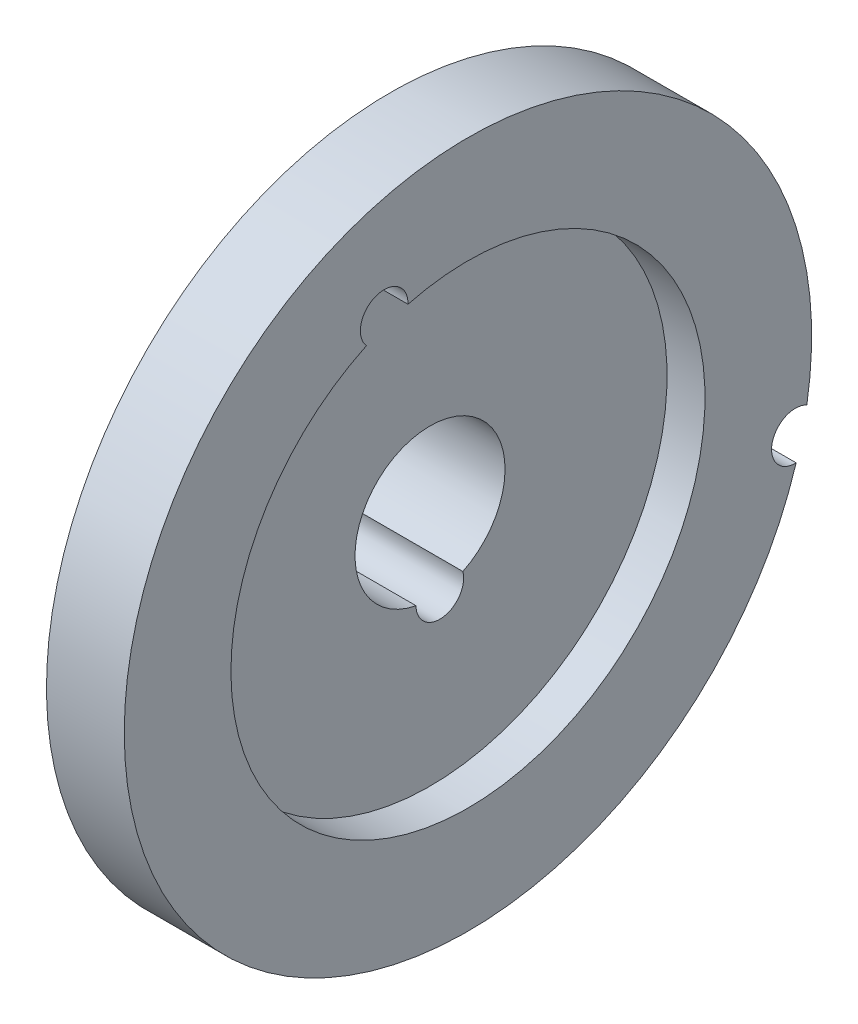
ISO-10303-21;
HEADER;
FILE_DESCRIPTION(('STEP AP214'),'2;1');
FILE_NAME('part.step','',(''),(''),'','','');
FILE_SCHEMA(('AUTOMOTIVE_DESIGN { 1 0 10303 214 1 1 1 1 }'));
ENDSEC;
DATA;
#1=APPLICATION_CONTEXT('core data for automotive mechanical design processes');
#2=APPLICATION_PROTOCOL_DEFINITION('international standard','automotive_design',2000,#1);
#3=PRODUCT_CONTEXT('',#1,'mechanical');
#4=PRODUCT('Part','Part','',(#3));
#5=PRODUCT_RELATED_PRODUCT_CATEGORY('part','',(#4));
#6=PRODUCT_DEFINITION_FORMATION('','',#4);
#7=PRODUCT_DEFINITION_CONTEXT('part definition',#1,'design');
#8=PRODUCT_DEFINITION('design','',#6,#7);
#9=PRODUCT_DEFINITION_SHAPE('','',#8);
#10=(LENGTH_UNIT() NAMED_UNIT(*) SI_UNIT(.MILLI.,.METRE.));
#11=(NAMED_UNIT(*) PLANE_ANGLE_UNIT() SI_UNIT($,.RADIAN.));
#12=(NAMED_UNIT(*) SI_UNIT($,.STERADIAN.) SOLID_ANGLE_UNIT());
#13=UNCERTAINTY_MEASURE_WITH_UNIT(LENGTH_MEASURE(1.E-05),#10,'distance_accuracy_value','');
#14=(GEOMETRIC_REPRESENTATION_CONTEXT(3) GLOBAL_UNCERTAINTY_ASSIGNED_CONTEXT((#13)) GLOBAL_UNIT_ASSIGNED_CONTEXT((#10,
#11,#12)) REPRESENTATION_CONTEXT('',''));
#15=CARTESIAN_POINT('',(0.,0.,0.));
#16=DIRECTION('',(0.,0.,1.));
#17=DIRECTION('',(1.,0.,0.));
#18=AXIS2_PLACEMENT_3D('',#15,#16,#17);
#19=CARTESIAN_POINT('',(-27.8572788918953,17.8013392215415,0.));
#20=DIRECTION('',(-1.,0.,0.));
#21=DIRECTION('',(0.,0.,1.));
#22=AXIS2_PLACEMENT_3D('',#19,#20,#21);
#23=PLANE('',#22);
#24=CARTESIAN_POINT('',(-27.8572788918953,-7.87461154428951,-1.05067261297217));
#25=DIRECTION('',(1.,0.,0.));
#26=DIRECTION('',(0.,0.,-1.));
#27=AXIS2_PLACEMENT_3D('',#24,#25,#26);
#28=CIRCLE('',#27,2.55270000000001);
#29=CARTESIAN_POINT('',(-27.8572788918953,-7.89755356007511,1.50192429094975));
#30=VERTEX_POINT('',#29);
#31=CARTESIAN_POINT('',(-27.8572788918953,-7.22750302201927,-3.51998989724434));
#32=VERTEX_POINT('',#31);
#33=EDGE_CURVE('E106',#30,#32,#28,.T.);
#34=ORIENTED_EDGE('',*,*,#33,.T.);
#35=CARTESIAN_POINT('',(-27.8572788918953,0.,0.));
#36=DIRECTION('',(1.,0.,0.));
#37=DIRECTION('',(0.,0.,-1.));
#38=AXIS2_PLACEMENT_3D('',#35,#36,#37);
#39=CIRCLE('',#38,8.0391);
#40=EDGE_CURVE('E124',#32,#30,#39,.T.);
#41=ORIENTED_EDGE('',*,*,#40,.T.);
#42=EDGE_LOOP('',(#34,#41));
#43=FACE_BOUND('',#42,.T.);
#44=CARTESIAN_POINT('',(-27.8572788918953,0.,0.));
#45=DIRECTION('',(1.,0.,0.));
#46=DIRECTION('',(0.,0.,-1.));
#47=AXIS2_PLACEMENT_3D('',#44,#45,#46);
#48=CIRCLE('',#47,17.8013392215415);
#49=CARTESIAN_POINT('',(-27.8572788918953,0.,-17.8013392215415));
#50=VERTEX_POINT('',#49);
#51=EDGE_CURVE('E115',#50,#50,#48,.T.);
#52=ORIENTED_EDGE('',*,*,#51,.F.);
#53=EDGE_LOOP('',(#52));
#54=FACE_BOUND('',#53,.T.);
#55=ADVANCED_FACE('F39',(#43,#54),#23,.T.);
#56=CARTESIAN_POINT('',(0.,0.,0.));
#57=DIRECTION('',(1.,0.,0.));
#58=DIRECTION('',(0.,0.,-1.));
#59=AXIS2_PLACEMENT_3D('',#56,#57,#58);
#60=CYLINDRICAL_SURFACE('',#59,8.0391);
#61=DIRECTION('',(1.,0.,0.));
#62=VECTOR('',#61,1.);
#63=CARTESIAN_POINT('',(-18.9086869451702,-7.22750302201927,-3.51998989724434));
#64=LINE('',#63,#62);
#65=CARTESIAN_POINT('',(-14.0240949984451,-7.22750302201927,-3.51998989724434));
#66=VERTEX_POINT('',#65);
#67=EDGE_CURVE('E165',#66,#32,#64,.F.);
#68=ORIENTED_EDGE('',*,*,#67,.F.);
#69=CARTESIAN_POINT('',(-14.0240949984451,0.,0.));
#70=DIRECTION('',(1.,0.,0.));
#71=DIRECTION('',(0.,0.,-1.));
#72=AXIS2_PLACEMENT_3D('',#69,#70,#71);
#73=CIRCLE('',#72,8.0391);
#74=CARTESIAN_POINT('',(-14.0240949984451,-7.89755356007511,1.50192429094975));
#75=VERTEX_POINT('',#74);
#76=EDGE_CURVE('E121',#66,#75,#73,.T.);
#77=ORIENTED_EDGE('',*,*,#76,.T.);
#78=DIRECTION('',(1.,0.,0.));
#79=VECTOR('',#78,1.);
#80=CARTESIAN_POINT('',(-18.9086869451702,-7.89755356007511,1.50192429094975));
#81=LINE('',#80,#79);
#82=EDGE_CURVE('E52',#30,#75,#81,.T.);
#83=ORIENTED_EDGE('',*,*,#82,.F.);
#84=ORIENTED_EDGE('',*,*,#40,.F.);
#85=EDGE_LOOP('',(#68,#77,#83,#84));
#86=FACE_BOUND('',#85,.T.);
#87=ADVANCED_FACE('F152',(#86),#60,.F.);
#88=CARTESIAN_POINT('',(-14.0240949984451,8.0391,0.));
#89=DIRECTION('',(1.,0.,0.));
#90=DIRECTION('',(0.,0.,-1.));
#91=AXIS2_PLACEMENT_3D('',#88,#89,#90);
#92=PLANE('',#91);
#93=CARTESIAN_POINT('',(-14.0240949984451,-7.87461154428951,-1.05067261297217));
#94=DIRECTION('',(1.,0.,0.));
#95=DIRECTION('',(0.,0.,-1.));
#96=AXIS2_PLACEMENT_3D('',#93,#94,#95);
#97=CIRCLE('',#96,2.55270000000001);
#98=EDGE_CURVE('E11',#75,#66,#97,.T.);
#99=ORIENTED_EDGE('',*,*,#98,.F.);
#100=ORIENTED_EDGE('',*,*,#76,.F.);
#101=EDGE_LOOP('',(#99,#100));
#102=FACE_BOUND('',#101,.T.);
#103=CARTESIAN_POINT('',(-14.0240949984451,24.6544495767758,8.97776177474859));
#104=DIRECTION('',(1.,0.,0.));
#105=DIRECTION('',(0.,0.,-1.));
#106=AXIS2_PLACEMENT_3D('',#103,#104,#105);
#107=CIRCLE('',#106,2.5527);
#108=CARTESIAN_POINT('',(-14.0240949984451,22.9519165222403,10.8797760986205));
#109=VERTEX_POINT('',#108);
#110=CARTESIAN_POINT('',(-14.0240949984451,24.5736062765692,6.42634223833132));
#111=VERTEX_POINT('',#110);
#112=EDGE_CURVE('E171',#109,#111,#107,.T.);
#113=ORIENTED_EDGE('',*,*,#112,.F.);
#114=CARTESIAN_POINT('',(-14.0240949984451,0.,0.));
#115=DIRECTION('',(1.,0.,0.));
#116=DIRECTION('',(0.,0.,-1.));
#117=AXIS2_PLACEMENT_3D('',#114,#115,#116);
#118=CIRCLE('',#117,25.4);
#119=EDGE_CURVE('E113',#109,#111,#118,.T.);
#120=ORIENTED_EDGE('',*,*,#119,.T.);
#121=EDGE_LOOP('',(#113,#120));
#122=FACE_BOUND('',#121,.T.);
#123=ADVANCED_FACE('F157',(#102,#122),#92,.T.);
#124=CARTESIAN_POINT('',(0.,0.,0.));
#125=DIRECTION('',(1.,0.,0.));
#126=DIRECTION('',(0.,0.,-1.));
#127=AXIS2_PLACEMENT_3D('',#124,#125,#126);
#128=CYLINDRICAL_SURFACE('',#127,25.4);
#129=DIRECTION('',(1.,0.,0.));
#130=VECTOR('',#129,1.);
#131=CARTESIAN_POINT('',(-18.9086869451702,22.9519165222403,10.8797760986205));
#132=LINE('',#131,#130);
#133=CARTESIAN_POINT('',(-9.9600949984451,22.9519165222403,10.8797760986205));
#134=VERTEX_POINT('',#133);
#135=EDGE_CURVE('E169',#134,#109,#132,.F.);
#136=ORIENTED_EDGE('',*,*,#135,.F.);
#137=CARTESIAN_POINT('',(-9.9600949984451,0.,0.));
#138=DIRECTION('',(1.,0.,0.));
#139=DIRECTION('',(0.,0.,-1.));
#140=AXIS2_PLACEMENT_3D('',#137,#138,#139);
#141=CIRCLE('',#140,25.4);
#142=CARTESIAN_POINT('',(-9.9600949984451,24.5736062765692,6.42634223833129));
#143=VERTEX_POINT('',#142);
#144=EDGE_CURVE('E109',#134,#143,#141,.T.);
#145=ORIENTED_EDGE('',*,*,#144,.T.);
#146=DIRECTION('',(1.,0.,0.));
#147=VECTOR('',#146,1.);
#148=CARTESIAN_POINT('',(-18.9086869451702,24.5736062765692,6.42634223833132));
#149=LINE('',#148,#147);
#150=EDGE_CURVE('E60',#111,#143,#149,.T.);
#151=ORIENTED_EDGE('',*,*,#150,.F.);
#152=ORIENTED_EDGE('',*,*,#119,.F.);
#153=EDGE_LOOP('',(#136,#145,#151,#152));
#154=FACE_BOUND('',#153,.T.);
#155=ADVANCED_FACE('F183',(#154),#128,.F.);
#156=CARTESIAN_POINT('',(-9.9600949984451,25.4,0.));
#157=DIRECTION('',(1.,0.,0.));
#158=DIRECTION('',(0.,0.,-1.));
#159=AXIS2_PLACEMENT_3D('',#156,#157,#158);
#160=PLANE('',#159);
#161=CARTESIAN_POINT('',(-9.9600949984451,24.6544495767758,8.97776177474859));
#162=DIRECTION('',(1.,0.,0.));
#163=DIRECTION('',(0.,0.,-1.));
#164=AXIS2_PLACEMENT_3D('',#161,#162,#163);
#165=CIRCLE('',#164,2.5527);
#166=EDGE_CURVE('E176',#143,#134,#165,.T.);
#167=ORIENTED_EDGE('',*,*,#166,.F.);
#168=ORIENTED_EDGE('',*,*,#144,.F.);
#169=EDGE_LOOP('',(#167,#168));
#170=FACE_BOUND('',#169,.T.);
#171=CARTESIAN_POINT('',(-9.9600949984451,-8.38903636907986,-35.0866048139046));
#172=DIRECTION('',(1.,0.,0.));
#173=DIRECTION('',(0.,0.,-1.));
#174=AXIS2_PLACEMENT_3D('',#171,#172,#173);
#175=CIRCLE('',#174,2.5527);
#176=CARTESIAN_POINT('',(-9.9600949984451,-6.15016269402234,-36.3128682265262));
#177=VERTEX_POINT('',#176);
#178=CARTESIAN_POINT('',(-9.9600949984451,-10.9404532116177,-35.1675330884099));
#179=VERTEX_POINT('',#178);
#180=EDGE_CURVE('E92',#177,#179,#175,.T.);
#181=ORIENTED_EDGE('',*,*,#180,.F.);
#182=CARTESIAN_POINT('',(-9.9600949984451,0.,0.));
#183=DIRECTION('',(1.,0.,0.));
#184=DIRECTION('',(0.,0.,-1.));
#185=AXIS2_PLACEMENT_3D('',#182,#183,#184);
#186=CIRCLE('',#185,36.83);
#187=EDGE_CURVE('E105',#177,#179,#186,.T.);
#188=ORIENTED_EDGE('',*,*,#187,.T.);
#189=EDGE_LOOP('',(#181,#188));
#190=FACE_BOUND('',#189,.T.);
#191=ADVANCED_FACE('F104',(#170,#190),#160,.T.);
#192=CARTESIAN_POINT('',(0.,0.,0.));
#193=DIRECTION('',(1.,0.,0.));
#194=DIRECTION('',(0.,0.,-1.));
#195=AXIS2_PLACEMENT_3D('',#192,#193,#194);
#196=CYLINDRICAL_SURFACE('',#195,36.83);
#197=DIRECTION('',(1.,0.,0.));
#198=VECTOR('',#197,1.);
#199=CARTESIAN_POINT('',(-18.9086869451702,-6.15016269402234,-36.3128682265262));
#200=LINE('',#199,#198);
#201=CARTESIAN_POINT('',(-18.2957572874948,-6.15016269402234,-36.3128682265262));
#202=VERTEX_POINT('',#201);
#203=EDGE_CURVE('E89',#202,#177,#200,.T.);
#204=ORIENTED_EDGE('',*,*,#203,.F.);
#205=CARTESIAN_POINT('',(-18.2957572874948,0.,0.));
#206=DIRECTION('',(1.,0.,0.));
#207=DIRECTION('',(0.,0.,-1.));
#208=AXIS2_PLACEMENT_3D('',#205,#206,#207);
#209=CIRCLE('',#208,36.83);
#210=CARTESIAN_POINT('',(-18.2957572874948,-10.9404532116177,-35.1675330884099));
#211=VERTEX_POINT('',#210);
#212=EDGE_CURVE('E110',#202,#211,#209,.T.);
#213=ORIENTED_EDGE('',*,*,#212,.T.);
#214=DIRECTION('',(1.,0.,0.));
#215=VECTOR('',#214,1.);
#216=CARTESIAN_POINT('',(-18.9086869451702,-10.9404532116177,-35.1675330884099));
#217=LINE('',#216,#215);
#218=EDGE_CURVE('E100',#179,#211,#217,.F.);
#219=ORIENTED_EDGE('',*,*,#218,.F.);
#220=ORIENTED_EDGE('',*,*,#187,.F.);
#221=EDGE_LOOP('',(#204,#213,#219,#220));
#222=FACE_BOUND('',#221,.T.);
#223=ADVANCED_FACE('F108',(#222),#196,.T.);
#224=CARTESIAN_POINT('',(-18.2957572874948,0.,0.));
#225=DIRECTION('',(1.,0.,0.));
#226=DIRECTION('',(0.,0.,-1.));
#227=AXIS2_PLACEMENT_3D('',#224,#225,#226);
#228=CONICAL_SURFACE('',#227,36.83,1.10516668084225);
#229=CARTESIAN_POINT('',(-24.8498703254199,22.5732563067455,7.49961703797649));
#230=CARTESIAN_POINT('',(-24.8682993667924,22.5006320562636,7.6018807482233));
#231=CARTESIAN_POINT('',(-24.8819276034358,22.4351186925605,7.71014531945761));
#232=CARTESIAN_POINT('',(-24.8988102809008,22.3206093947254,7.93588858705027));
#233=CARTESIAN_POINT('',(-24.9020602025703,22.271620664411,8.05337127455468));
#234=CARTESIAN_POINT('',(-24.8979927543314,22.1917222813513,8.29414288498326));
#235=CARTESIAN_POINT('',(-24.8906766029869,22.1608105444004,8.41743113677716));
#236=CARTESIAN_POINT('',(-24.8658957390145,22.1176883657887,8.66620792935989));
#237=CARTESIAN_POINT('',(-24.8484306881588,22.1054785474474,8.79169654334401));
#238=CARTESIAN_POINT('',(-24.804170172124,22.0994736924204,9.04202610742217));
#239=CARTESIAN_POINT('',(-24.7773312625779,22.1057654288794,9.1668612459922));
#240=CARTESIAN_POINT('',(-24.7155880521999,22.1359666771943,9.41230264897276));
#241=CARTESIAN_POINT('',(-24.6806816636962,22.1598807528046,9.53290780944499));
#242=CARTESIAN_POINT('',(-24.6010187789752,22.2265666371304,9.77711835787687));
#243=CARTESIAN_POINT('',(-24.5556884532743,22.2707269951947,9.90015542401981));
#244=CARTESIAN_POINT('',(-24.4588755010697,22.3760222782233,10.1361054162251));
#245=CARTESIAN_POINT('',(-24.407390130892,22.4371647893463,10.2490137877706));
#246=CARTESIAN_POINT('',(-24.2934454565968,22.582516080236,10.47561441615));
#247=CARTESIAN_POINT('',(-24.2304087060826,22.6685995948494,10.587814195634));
#248=CARTESIAN_POINT('',(-24.1005254556218,22.8566638509335,10.7954214203554));
#249=CARTESIAN_POINT('',(-24.033677168255,22.9586520904748,10.8908208999156));
#250=CARTESIAN_POINT('',(-23.8907229064997,23.1873330471663,11.0723571506778));
#251=CARTESIAN_POINT('',(-23.8143828771448,23.3154959951355,11.1564634447022));
#252=CARTESIAN_POINT('',(-23.6612049646513,23.5845402807693,11.3004475361739));
#253=CARTESIAN_POINT('',(-23.5843669111922,23.7254262085859,11.3603165463244));
#254=CARTESIAN_POINT('',(-23.4283719312605,24.0235565924521,11.4564646635031));
#255=CARTESIAN_POINT('',(-23.3492878444658,24.1812652915785,11.4914330019042));
#256=CARTESIAN_POINT('',(-23.1949357672782,24.5023256639332,11.5310520451297));
#257=CARTESIAN_POINT('',(-23.1196678395496,24.6656774297509,11.5357022522666));
#258=CARTESIAN_POINT('',(-22.9770665990305,24.9888513193822,11.5135101845232));
#259=CARTESIAN_POINT('',(-22.909581262449,25.1486588030803,11.4874575836864));
#260=CARTESIAN_POINT('',(-22.7826931375615,25.4633997166836,11.404348460588));
#261=CARTESIAN_POINT('',(-22.723286115148,25.6183356669244,11.3473082588599));
#262=CARTESIAN_POINT('',(-22.6194840367741,25.9045069099703,11.2086238001369));
#263=CARTESIAN_POINT('',(-22.5742444463783,26.0366385245728,11.1294672746704));
#264=CARTESIAN_POINT('',(-22.4942985302087,26.2864207811094,10.9467294984592));
#265=CARTESIAN_POINT('',(-22.459584085464,26.4040825430531,10.8431671842154));
#266=CARTESIAN_POINT('',(-22.4051713769758,26.6087566449767,10.6260705098812));
#267=CARTESIAN_POINT('',(-22.3843064791187,26.6976678295553,10.5146157376535));
#268=CARTESIAN_POINT('',(-22.3532059060492,26.8561571784384,10.2774045390046));
#269=CARTESIAN_POINT('',(-22.3429646900579,26.9257454067432,10.1516556057117));
#270=CARTESIAN_POINT('',(-22.333890740429,27.0387003846449,9.89936265460186));
#271=CARTESIAN_POINT('',(-22.3342906630613,27.0835927422073,9.77352590849395));
#272=CARTESIAN_POINT('',(-22.3446007911755,27.1531347144374,9.51677004778981));
#273=CARTESIAN_POINT('',(-22.354509499849,27.177787513945,9.38585173621122));
#274=CARTESIAN_POINT('',(-22.3832186165097,27.2062240366269,9.12496247445079));
#275=CARTESIAN_POINT('',(-22.4018707517761,27.2103429114564,8.99501112089692));
#276=CARTESIAN_POINT('',(-22.4473578228699,27.1990800383011,8.73742911204783));
#277=CARTESIAN_POINT('',(-22.4741937425497,27.1836959449718,8.60979873773609));
#278=CARTESIAN_POINT('',(-22.5363982562347,27.1335744181737,8.35509279996491));
#279=CARTESIAN_POINT('',(-22.5720593881646,27.0981039651005,8.22823394968339));
#280=CARTESIAN_POINT('',(-22.6502314532285,27.0090868212246,7.98329803558738));
#281=CARTESIAN_POINT('',(-22.692744391415,26.9555348341623,7.86522355718244));
#282=CARTESIAN_POINT('',(-22.7870898599397,26.8275658794759,7.63128981123061));
#283=CARTESIAN_POINT('',(-22.8393929130825,26.7518367074448,7.51633923740806));
#284=CARTESIAN_POINT('',(-22.9492973688424,26.5845047959959,7.30153912917043));
#285=CARTESIAN_POINT('',(-23.0069008252262,26.4928958913455,7.20169548825452));
#286=CARTESIAN_POINT('',(-23.1317406094489,26.2872201636243,7.01004353092244));
#287=CARTESIAN_POINT('',(-23.1993725007108,26.1718478277414,6.91989317691898));
#288=CARTESIAN_POINT('',(-23.3377525601159,25.9288030452068,6.76114426151495));
#289=CARTESIAN_POINT('',(-23.4085019598254,25.8011257134086,6.69255430613873));
#290=CARTESIAN_POINT('',(-23.5572812397535,25.5260934283422,6.57344617225069));
#291=CARTESIAN_POINT('',(-23.6354386515314,25.3779818232817,6.52482777109594));
#292=CARTESIAN_POINT('',(-23.7914844187581,25.0752334129748,6.45519079172249));
#293=CARTESIAN_POINT('',(-23.8693726883125,24.9205947013807,6.43418033523418));
#294=CARTESIAN_POINT('',(-24.0251456825829,24.6038680462492,6.42049377172206));
#295=CARTESIAN_POINT('',(-24.1029520613846,24.4416993399955,6.42873676303048));
#296=CARTESIAN_POINT('',(-24.2533060118,24.1194105562519,6.4764481444283));
#297=CARTESIAN_POINT('',(-24.3258521442447,23.9592910492031,6.51592504498494));
#298=CARTESIAN_POINT('',(-24.4595790761833,23.6532968018899,6.6242380293179));
#299=CARTESIAN_POINT('',(-24.521120138459,23.5071052661084,6.69170167164584));
#300=CARTESIAN_POINT('',(-24.6052167372038,23.2973524656861,6.8141690903561));
#301=CARTESIAN_POINT('',(-24.6318680189688,23.2290570591699,6.85850825305137));
#302=CARTESIAN_POINT('',(-24.6820660852416,23.0963029860177,6.95411733029773));
#303=CARTESIAN_POINT('',(-24.7056143845698,23.0318424557578,7.00538383809925));
#304=CARTESIAN_POINT('',(-24.7531392011039,22.896292795504,7.12446772791408));
#305=CARTESIAN_POINT('',(-24.776425003272,22.826108990482,7.19360207303471));
#306=CARTESIAN_POINT('',(-24.817446431492,22.6935309408584,7.34042710924933));
#307=CARTESIAN_POINT('',(-24.8351830056348,22.6311353667261,7.41811633566382));
#308=CARTESIAN_POINT('',(-24.8498703254199,22.5732563067455,7.49961703797649));
#309=B_SPLINE_CURVE_WITH_KNOTS('',3,(#229,#230,#231,#232,#233,#234,#235,#236,#237,#238,#239,
#240,#241,#242,#243,#244,#245,#246,#247,#248,#249,#250,#251,#252,#253,#254,#255,#256,#257,#258,
#259,#260,#261,#262,#263,#264,#265,#266,#267,#268,#269,#270,#271,#272,#273,#274,#275,#276,#277,
#278,#279,#280,#281,#282,#283,#284,#285,#286,#287,#288,#289,#290,#291,#292,#293,#294,#295,#296,
#297,#298,#299,#300,#301,#302,#303,#304,#305,#306,#307,#308),.UNSPECIFIED.,.T.,.F.,(4,2,2,2,2,2,
2,2,2,2,2,2,2,2,2,2,2,2,2,2,2,2,2,2,2,2,2,2,2,2,2,2,2,2,2,2,2,2,2,4),(0.,0.379980095286268,
0.760125627241842,1.14022732128188,1.52034168352587,1.90224163873021,2.28424053144518,
2.6976404310507,3.11122529985421,3.57381806771531,4.03662958175311,4.54813281752808,
5.05982133454755,5.59677556584797,6.1337386114987,6.65718708213176,7.18036013009845,
7.65930355249932,8.13787657818339,8.56786671654332,8.99763248071315,9.39649735364701,
9.79529945029061,10.1875705474066,10.579888821859,10.9875429228193,11.395316533425,
11.8352414734304,12.2753375963778,12.7571371189287,13.2391287125388,13.7599292253836,
14.2808829135241,14.8183470801425,15.3559577428992,15.8698446107395,16.1265206753893,
16.3830709674674,16.6859539684541,16.9887851932936),.UNSPECIFIED.);
#310=CARTESIAN_POINT('',(-24.8498703254199,22.5732563067455,7.49961703797649));
#311=VERTEX_POINT('',#310);
#312=EDGE_CURVE('E99',#311,#311,#309,.T.);
#313=ORIENTED_EDGE('',*,*,#312,.F.);
#314=EDGE_LOOP('',(#313));
#315=FACE_BOUND('',#314,.T.);
#316=CARTESIAN_POINT('',(-18.2955572874948,-10.9404398229633,-35.167954094857));
#317=CARTESIAN_POINT('',(-18.3720175119002,-10.9456082120504,-35.0069481959034));
#318=CARTESIAN_POINT('',(-18.4504647067413,-10.9354404436038,-34.8465298478143));
#319=CARTESIAN_POINT('',(-18.609132116167,-10.8856765568094,-34.5311838783582));
#320=CARTESIAN_POINT('',(-18.6893525727549,-10.8460763973587,-34.3762570140393));
#321=CARTESIAN_POINT('',(-18.8493335076218,-10.7386975781525,-34.0762747327745));
#322=CARTESIAN_POINT('',(-18.9290940413875,-10.6709223928417,-33.9312181012322));
#323=CARTESIAN_POINT('',(-19.0858395768544,-10.5086749855809,-33.6551614193842));
#324=CARTESIAN_POINT('',(-19.1628246593238,-10.4142035412264,-33.5241609598106));
#325=CARTESIAN_POINT('',(-19.3108916816782,-10.2011649490334,-33.281516655823));
#326=CARTESIAN_POINT('',(-19.382012724897,-10.0827793364517,-33.1697380768595));
#327=CARTESIAN_POINT('',(-19.5160716584757,-9.82393193165956,-32.9690285732461));
#328=CARTESIAN_POINT('',(-19.5790128284618,-9.68347903727681,-32.8800884777235));
#329=CARTESIAN_POINT('',(-19.6885764529046,-9.39691788712964,-32.7363006432417));
#330=CARTESIAN_POINT('',(-19.7361308802216,-9.25230317699607,-32.6791988882712));
#331=CARTESIAN_POINT('',(-19.8189675782857,-8.95188040864959,-32.5918360005384));
#332=CARTESIAN_POINT('',(-19.8542637077719,-8.79608523275532,-32.5615444967683));
#333=CARTESIAN_POINT('',(-19.9066887827634,-8.49892611941338,-32.5324648392093));
#334=CARTESIAN_POINT('',(-19.9255412568931,-8.35820347011971,-32.5302014747244));
#335=CARTESIAN_POINT('',(-19.9508930302894,-8.07723695879211,-32.5491184492807));
#336=CARTESIAN_POINT('',(-19.9574006048663,-7.93699283897294,-32.5702830684689));
#337=CARTESIAN_POINT('',(-19.957645689386,-7.67450126942521,-32.6325781510369));
#338=CARTESIAN_POINT('',(-19.9524899449822,-7.55177655022236,-32.6717194202578));
#339=CARTESIAN_POINT('',(-19.9319306175595,-7.31435326321194,-32.767614056462));
#340=CARTESIAN_POINT('',(-19.9165279982067,-7.19965394177762,-32.8243657670054));
#341=CARTESIAN_POINT('',(-19.876390964129,-6.98190741239218,-32.9530233162497));
#342=CARTESIAN_POINT('',(-19.851713955896,-6.87879349208968,-33.024834753833));
#343=CARTESIAN_POINT('',(-19.794138119669,-6.68553121798611,-33.1813945642691));
#344=CARTESIAN_POINT('',(-19.7612373498528,-6.59538593431484,-33.2661459907134));
#345=CARTESIAN_POINT('',(-19.685880440311,-6.42354228435801,-33.4524988096219));
#346=CARTESIAN_POINT('',(-19.6429091536132,-6.34290931187187,-33.5548718357794));
#347=CARTESIAN_POINT('',(-19.550571253029,-6.19912566325745,-33.7685846017891));
#348=CARTESIAN_POINT('',(-19.5012020911189,-6.13598198403403,-33.8799279074331));
#349=CARTESIAN_POINT('',(-19.3917536296759,-6.02154519171615,-34.1216769494513));
#350=CARTESIAN_POINT('',(-19.3310940450286,-5.97236865580446,-34.2528216108154));
#351=CARTESIAN_POINT('',(-19.2055550054833,-5.89626553486122,-34.5194874738452));
#352=CARTESIAN_POINT('',(-19.1406731043648,-5.86935197403967,-34.6550111892322));
#353=CARTESIAN_POINT('',(-19.0012392259032,-5.83591544378171,-34.9420289567288));
#354=CARTESIAN_POINT('',(-18.9263970703419,-5.83189280895268,-35.0936750177736));
#355=CARTESIAN_POINT('',(-18.7756262606876,-5.85051917566549,-35.3947339895436));
#356=CARTESIAN_POINT('',(-18.6996978646779,-5.87316194234042,-35.5441474140297));
#357=CARTESIAN_POINT('',(-18.5684452327773,-5.93513082832509,-35.7986534066412));
#358=CARTESIAN_POINT('',(-18.5129250531711,-5.96854605242114,-35.9051188479932));
#359=CARTESIAN_POINT('',(-18.4031406110776,-6.04918907849636,-36.1131639613577));
#360=CARTESIAN_POINT('',(-18.3488748429804,-6.09639928281611,-36.2147496671735));
#361=CARTESIAN_POINT('',(-18.2955572874948,-6.15036506938979,-36.3132376448462));
#362=B_SPLINE_CURVE_WITH_KNOTS('',3,(#316,#317,#318,#319,#320,#321,#322,#323,#324,#325,#326,
#327,#328,#329,#330,#331,#332,#333,#334,#335,#336,#337,#338,#339,#340,#341,#342,#343,#344,#345,
#346,#347,#348,#349,#350,#351,#352,#353,#354,#355,#356,#357,#358,#359,#360,#361),.UNSPECIFIED.,
.F.,.F.,(4,2,2,2,2,2,2,2,2,2,2,2,2,2,2,2,2,2,2,2,2,2,4),(0.,0.534118833519606,1.06831101575448,
1.60243734282463,2.13654811372663,2.66674725053285,3.19673314991143,3.68170493465925,
4.16612663117629,4.58978098764598,5.01315125012077,5.3980474729348,5.78290750334057,
6.16542355001115,6.54803000311703,6.95800346702899,7.36814071203225,7.82416976234178,
8.28046540891605,8.78576622509507,9.29094891599767,9.66402925238867,10.0366357286974),.UNSPECIFIED.);
#363=EDGE_CURVE('E46',#211,#202,#362,.T.);
#364=ORIENTED_EDGE('',*,*,#363,.F.);
#365=ORIENTED_EDGE('',*,*,#212,.F.);
#366=EDGE_LOOP('',(#364,#365));
#367=FACE_BOUND('',#366,.T.);
#368=ORIENTED_EDGE('',*,*,#51,.T.);
#369=EDGE_LOOP('',(#368));
#370=FACE_BOUND('',#369,.T.);
#371=ADVANCED_FACE('F137',(#315,#367,#370),#228,.T.);
#372=CARTESIAN_POINT('',(-27.8572788918953,-8.38903636907986,-35.0866048139046));
#373=DIRECTION('',(1.,0.,0.));
#374=DIRECTION('',(0.,0.,-1.));
#375=AXIS2_PLACEMENT_3D('',#372,#373,#374);
#376=CYLINDRICAL_SURFACE('',#375,2.5527);
#377=ORIENTED_EDGE('',*,*,#203,.T.);
#378=ORIENTED_EDGE('',*,*,#180,.T.);
#379=ORIENTED_EDGE('',*,*,#218,.T.);
#380=ORIENTED_EDGE('',*,*,#363,.T.);
#381=EDGE_LOOP('',(#377,#378,#379,#380));
#382=FACE_BOUND('',#381,.T.);
#383=ADVANCED_FACE('F91',(#382),#376,.F.);
#384=CARTESIAN_POINT('',(-27.8572788918953,24.6544495767758,8.97776177474859));
#385=DIRECTION('',(1.,0.,0.));
#386=DIRECTION('',(0.,0.,-1.));
#387=AXIS2_PLACEMENT_3D('',#384,#385,#386);
#388=CYLINDRICAL_SURFACE('',#387,2.5527);
#389=ORIENTED_EDGE('',*,*,#135,.T.);
#390=ORIENTED_EDGE('',*,*,#112,.T.);
#391=ORIENTED_EDGE('',*,*,#150,.T.);
#392=ORIENTED_EDGE('',*,*,#166,.T.);
#393=EDGE_LOOP('',(#389,#390,#391,#392));
#394=FACE_BOUND('',#393,.T.);
#395=ORIENTED_EDGE('',*,*,#312,.T.);
#396=EDGE_LOOP('',(#395));
#397=FACE_BOUND('',#396,.T.);
#398=ADVANCED_FACE('F143',(#394,#397),#388,.F.);
#399=CARTESIAN_POINT('',(-27.8572788918953,-7.87461154428951,-1.05067261297217));
#400=DIRECTION('',(1.,0.,0.));
#401=DIRECTION('',(0.,0.,-1.));
#402=AXIS2_PLACEMENT_3D('',#399,#400,#401);
#403=CYLINDRICAL_SURFACE('',#402,2.55270000000001);
#404=ORIENTED_EDGE('',*,*,#67,.T.);
#405=ORIENTED_EDGE('',*,*,#33,.F.);
#406=ORIENTED_EDGE('',*,*,#82,.T.);
#407=ORIENTED_EDGE('',*,*,#98,.T.);
#408=EDGE_LOOP('',(#404,#405,#406,#407));
#409=FACE_BOUND('',#408,.T.);
#410=ADVANCED_FACE('F144',(#409),#403,.F.);
#411=CLOSED_SHELL('',(#55,#87,#123,#155,#191,#223,#371,#383,#398,#410));
#412=MANIFOLD_SOLID_BREP('B2',#411);
#413=ADVANCED_BREP_SHAPE_REPRESENTATION('',(#18,#412),#14);
#414=SHAPE_DEFINITION_REPRESENTATION(#9,#413);
ENDSEC;
END-ISO-10303-21;
